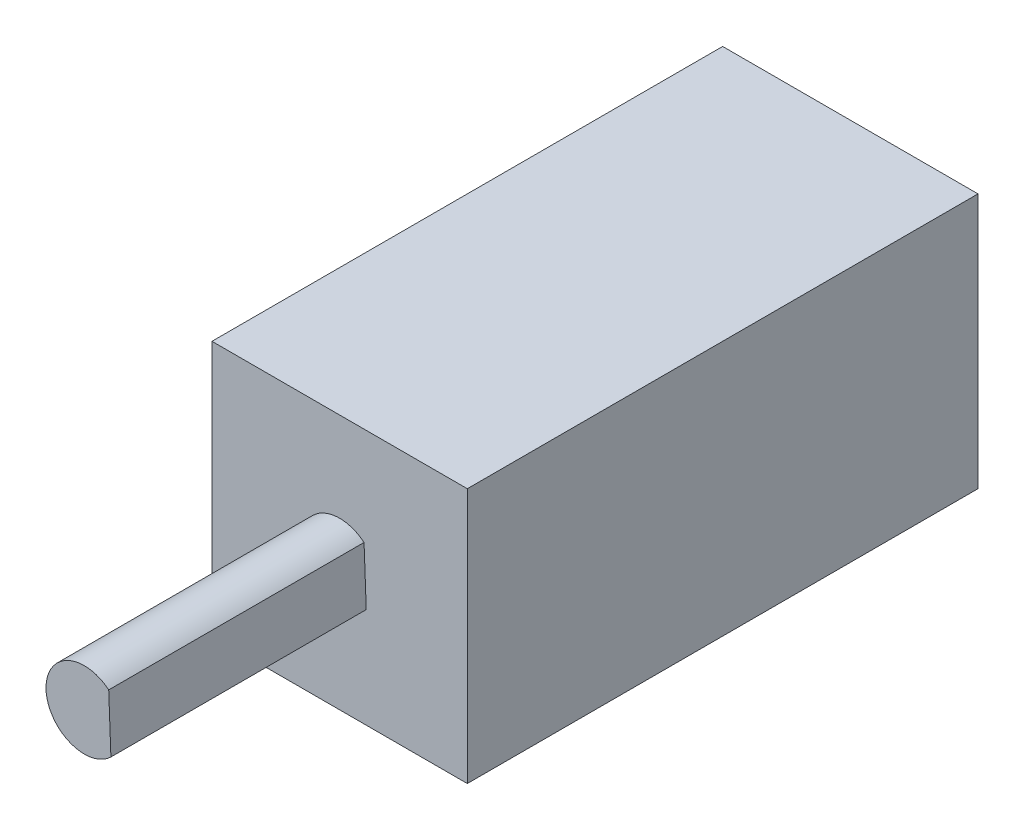
ISO-10303-21;
HEADER;
FILE_DESCRIPTION(('STEP AP214'),'2;1');
FILE_NAME('part.step','',(''),(''),'','','');
FILE_SCHEMA(('AUTOMOTIVE_DESIGN { 1 0 10303 214 1 1 1 1 }'));
ENDSEC;
DATA;
#1=APPLICATION_CONTEXT('core data for automotive mechanical design processes');
#2=APPLICATION_PROTOCOL_DEFINITION('international standard','automotive_design',2000,#1);
#3=PRODUCT_CONTEXT('',#1,'mechanical');
#4=PRODUCT('Part','Part','',(#3));
#5=PRODUCT_RELATED_PRODUCT_CATEGORY('part','',(#4));
#6=PRODUCT_DEFINITION_FORMATION('','',#4);
#7=PRODUCT_DEFINITION_CONTEXT('part definition',#1,'design');
#8=PRODUCT_DEFINITION('design','',#6,#7);
#9=PRODUCT_DEFINITION_SHAPE('','',#8);
#10=(LENGTH_UNIT() NAMED_UNIT(*) SI_UNIT(.MILLI.,.METRE.));
#11=(NAMED_UNIT(*) PLANE_ANGLE_UNIT() SI_UNIT($,.RADIAN.));
#12=(NAMED_UNIT(*) SI_UNIT($,.STERADIAN.) SOLID_ANGLE_UNIT());
#13=UNCERTAINTY_MEASURE_WITH_UNIT(LENGTH_MEASURE(1.E-05),#10,'distance_accuracy_value','');
#14=(GEOMETRIC_REPRESENTATION_CONTEXT(3) GLOBAL_UNCERTAINTY_ASSIGNED_CONTEXT((#13)) GLOBAL_UNIT_ASSIGNED_CONTEXT((#10,
#11,#12)) REPRESENTATION_CONTEXT('',''));
#15=CARTESIAN_POINT('',(0.,0.,0.));
#16=DIRECTION('',(0.,0.,1.));
#17=DIRECTION('',(1.,0.,0.));
#18=AXIS2_PLACEMENT_3D('',#15,#16,#17);
#19=CARTESIAN_POINT('',(0.,0.,20.));
#20=DIRECTION('',(0.,0.,-1.));
#21=DIRECTION('',(-1.,0.,0.));
#22=AXIS2_PLACEMENT_3D('',#19,#20,#21);
#23=PLANE('',#22);
#24=DIRECTION('',(1.,0.,0.));
#25=VECTOR('',#24,1.);
#26=CARTESIAN_POINT('',(-5.,-5.,20.));
#27=LINE('',#26,#25);
#28=CARTESIAN_POINT('',(-5.,-5.,20.));
#29=VERTEX_POINT('',#28);
#30=CARTESIAN_POINT('',(5.,-5.,20.));
#31=VERTEX_POINT('',#30);
#32=EDGE_CURVE('E82',#29,#31,#27,.T.);
#33=ORIENTED_EDGE('',*,*,#32,.T.);
#34=DIRECTION('',(0.,-1.,0.));
#35=VECTOR('',#34,1.);
#36=CARTESIAN_POINT('',(5.,5.,20.));
#37=LINE('',#36,#35);
#38=CARTESIAN_POINT('',(5.,5.,20.));
#39=VERTEX_POINT('',#38);
#40=EDGE_CURVE('E120',#39,#31,#37,.T.);
#41=ORIENTED_EDGE('',*,*,#40,.F.);
#42=DIRECTION('',(1.,0.,0.));
#43=VECTOR('',#42,1.);
#44=CARTESIAN_POINT('',(-5.,5.,20.));
#45=LINE('',#44,#43);
#46=CARTESIAN_POINT('',(-5.,5.,20.));
#47=VERTEX_POINT('',#46);
#48=EDGE_CURVE('E123',#47,#39,#45,.T.);
#49=ORIENTED_EDGE('',*,*,#48,.F.);
#50=DIRECTION('',(0.,-1.,0.));
#51=VECTOR('',#50,1.);
#52=CARTESIAN_POINT('',(-5.,5.,20.));
#53=LINE('',#52,#51);
#54=EDGE_CURVE('E57',#47,#29,#53,.T.);
#55=ORIENTED_EDGE('',*,*,#54,.T.);
#56=EDGE_LOOP('',(#33,#41,#49,#55));
#57=FACE_BOUND('',#56,.T.);
#58=CARTESIAN_POINT('',(0.,0.,20.));
#59=DIRECTION('',(0.,0.,1.));
#60=DIRECTION('',(1.,0.,0.));
#61=AXIS2_PLACEMENT_3D('',#58,#59,#60);
#62=CIRCLE('',#61,1.5);
#63=CARTESIAN_POINT('',(0.95639116203314,1.15555871559385,20.));
#64=VERTEX_POINT('',#63);
#65=CARTESIAN_POINT('',(1.04213779980085,-1.07886459123759,20.));
#66=VERTEX_POINT('',#65);
#67=EDGE_CURVE('E110',#64,#66,#62,.T.);
#68=ORIENTED_EDGE('',*,*,#67,.F.);
#69=DIRECTION('',(-0.0383470621781279,0.999264480916993,0.));
#70=VECTOR('',#69,1.);
#71=CARTESIAN_POINT('',(0.95639116203314,1.15555871559385,20.));
#72=LINE('',#71,#70);
#73=EDGE_CURVE('E48',#66,#64,#72,.T.);
#74=ORIENTED_EDGE('',*,*,#73,.F.);
#75=EDGE_LOOP('',(#68,#74));
#76=FACE_BOUND('',#75,.T.);
#77=ADVANCED_FACE('F34',(#57,#76),#23,.F.);
#78=CARTESIAN_POINT('',(-5.,-5.,20.));
#79=DIRECTION('',(0.,1.,0.));
#80=DIRECTION('',(0.,0.,1.));
#81=AXIS2_PLACEMENT_3D('',#78,#79,#80);
#82=PLANE('',#81);
#83=DIRECTION('',(1.,0.,0.));
#84=VECTOR('',#83,1.);
#85=CARTESIAN_POINT('',(-5.,-5.,0.));
#86=LINE('',#85,#84);
#87=CARTESIAN_POINT('',(-5.,-5.,0.));
#88=VERTEX_POINT('',#87);
#89=CARTESIAN_POINT('',(5.,-5.,0.));
#90=VERTEX_POINT('',#89);
#91=EDGE_CURVE('E111',#88,#90,#86,.T.);
#92=ORIENTED_EDGE('',*,*,#91,.T.);
#93=DIRECTION('',(0.,0.,-1.));
#94=VECTOR('',#93,1.);
#95=CARTESIAN_POINT('',(5.,-5.,20.));
#96=LINE('',#95,#94);
#97=EDGE_CURVE('E11',#31,#90,#96,.T.);
#98=ORIENTED_EDGE('',*,*,#97,.F.);
#99=ORIENTED_EDGE('',*,*,#32,.F.);
#100=DIRECTION('',(0.,0.,-1.));
#101=VECTOR('',#100,1.);
#102=CARTESIAN_POINT('',(-5.,-5.,20.));
#103=LINE('',#102,#101);
#104=EDGE_CURVE('E126',#29,#88,#103,.T.);
#105=ORIENTED_EDGE('',*,*,#104,.T.);
#106=EDGE_LOOP('',(#92,#98,#99,#105));
#107=FACE_BOUND('',#106,.T.);
#108=ADVANCED_FACE('F36',(#107),#82,.F.);
#109=CARTESIAN_POINT('',(5.,5.,20.));
#110=DIRECTION('',(1.,0.,0.));
#111=DIRECTION('',(0.,0.,-1.));
#112=AXIS2_PLACEMENT_3D('',#109,#110,#111);
#113=PLANE('',#112);
#114=DIRECTION('',(0.,-1.,0.));
#115=VECTOR('',#114,1.);
#116=CARTESIAN_POINT('',(5.,5.,0.));
#117=LINE('',#116,#115);
#118=CARTESIAN_POINT('',(5.,5.,0.));
#119=VERTEX_POINT('',#118);
#120=EDGE_CURVE('E114',#119,#90,#117,.T.);
#121=ORIENTED_EDGE('',*,*,#120,.F.);
#122=DIRECTION('',(0.,0.,-1.));
#123=VECTOR('',#122,1.);
#124=CARTESIAN_POINT('',(5.,5.,20.));
#125=LINE('',#124,#123);
#126=EDGE_CURVE('E42',#39,#119,#125,.T.);
#127=ORIENTED_EDGE('',*,*,#126,.F.);
#128=ORIENTED_EDGE('',*,*,#40,.T.);
#129=ORIENTED_EDGE('',*,*,#97,.T.);
#130=EDGE_LOOP('',(#121,#127,#128,#129));
#131=FACE_BOUND('',#130,.T.);
#132=ADVANCED_FACE('F141',(#131),#113,.T.);
#133=CARTESIAN_POINT('',(-5.,5.,20.));
#134=DIRECTION('',(0.,1.,0.));
#135=DIRECTION('',(0.,0.,1.));
#136=AXIS2_PLACEMENT_3D('',#133,#134,#135);
#137=PLANE('',#136);
#138=DIRECTION('',(1.,0.,0.));
#139=VECTOR('',#138,1.);
#140=CARTESIAN_POINT('',(-5.,5.,0.));
#141=LINE('',#140,#139);
#142=CARTESIAN_POINT('',(-5.,5.,0.));
#143=VERTEX_POINT('',#142);
#144=EDGE_CURVE('E130',#143,#119,#141,.T.);
#145=ORIENTED_EDGE('',*,*,#144,.F.);
#146=DIRECTION('',(0.,0.,-1.));
#147=VECTOR('',#146,1.);
#148=CARTESIAN_POINT('',(-5.,5.,20.));
#149=LINE('',#148,#147);
#150=EDGE_CURVE('E135',#47,#143,#149,.T.);
#151=ORIENTED_EDGE('',*,*,#150,.F.);
#152=ORIENTED_EDGE('',*,*,#48,.T.);
#153=ORIENTED_EDGE('',*,*,#126,.T.);
#154=EDGE_LOOP('',(#145,#151,#152,#153));
#155=FACE_BOUND('',#154,.T.);
#156=ADVANCED_FACE('F139',(#155),#137,.T.);
#157=CARTESIAN_POINT('',(-5.,5.,20.));
#158=DIRECTION('',(1.,0.,0.));
#159=DIRECTION('',(0.,0.,-1.));
#160=AXIS2_PLACEMENT_3D('',#157,#158,#159);
#161=PLANE('',#160);
#162=DIRECTION('',(0.,-1.,0.));
#163=VECTOR('',#162,1.);
#164=CARTESIAN_POINT('',(-5.,5.,0.));
#165=LINE('',#164,#163);
#166=EDGE_CURVE('E77',#143,#88,#165,.T.);
#167=ORIENTED_EDGE('',*,*,#166,.T.);
#168=ORIENTED_EDGE('',*,*,#104,.F.);
#169=ORIENTED_EDGE('',*,*,#54,.F.);
#170=ORIENTED_EDGE('',*,*,#150,.T.);
#171=EDGE_LOOP('',(#167,#168,#169,#170));
#172=FACE_BOUND('',#171,.T.);
#173=ADVANCED_FACE('F146',(#172),#161,.F.);
#174=CARTESIAN_POINT('',(0.,0.,0.));
#175=DIRECTION('',(0.,0.,-1.));
#176=DIRECTION('',(-1.,0.,0.));
#177=AXIS2_PLACEMENT_3D('',#174,#175,#176);
#178=PLANE('',#177);
#179=ORIENTED_EDGE('',*,*,#91,.F.);
#180=ORIENTED_EDGE('',*,*,#166,.F.);
#181=ORIENTED_EDGE('',*,*,#144,.T.);
#182=ORIENTED_EDGE('',*,*,#120,.T.);
#183=EDGE_LOOP('',(#179,#180,#181,#182));
#184=FACE_BOUND('',#183,.T.);
#185=ADVANCED_FACE('F144',(#184),#178,.T.);
#186=CARTESIAN_POINT('',(0.,0.,30.));
#187=DIRECTION('',(0.,0.,-1.));
#188=DIRECTION('',(-1.,0.,0.));
#189=AXIS2_PLACEMENT_3D('',#186,#187,#188);
#190=CYLINDRICAL_SURFACE('',#189,1.5);
#191=ORIENTED_EDGE('',*,*,#67,.T.);
#192=DIRECTION('',(0.,0.,-1.));
#193=VECTOR('',#192,1.);
#194=CARTESIAN_POINT('',(1.04213779980085,-1.07886459123759,30.));
#195=LINE('',#194,#193);
#196=CARTESIAN_POINT('',(1.04213779980085,-1.07886459123759,30.));
#197=VERTEX_POINT('',#196);
#198=EDGE_CURVE('E98',#197,#66,#195,.T.);
#199=ORIENTED_EDGE('',*,*,#198,.F.);
#200=CARTESIAN_POINT('',(0.,0.,30.));
#201=DIRECTION('',(0.,0.,1.));
#202=DIRECTION('',(1.,0.,0.));
#203=AXIS2_PLACEMENT_3D('',#200,#201,#202);
#204=CIRCLE('',#203,1.5);
#205=CARTESIAN_POINT('',(0.95639116203314,1.15555871559385,30.));
#206=VERTEX_POINT('',#205);
#207=EDGE_CURVE('E104',#206,#197,#204,.T.);
#208=ORIENTED_EDGE('',*,*,#207,.F.);
#209=DIRECTION('',(0.,0.,-1.));
#210=VECTOR('',#209,1.);
#211=CARTESIAN_POINT('',(0.95639116203314,1.15555871559385,30.));
#212=LINE('',#211,#210);
#213=EDGE_CURVE('E101',#206,#64,#212,.T.);
#214=ORIENTED_EDGE('',*,*,#213,.T.);
#215=EDGE_LOOP('',(#191,#199,#208,#214));
#216=FACE_BOUND('',#215,.T.);
#217=ADVANCED_FACE('F109',(#216),#190,.T.);
#218=CARTESIAN_POINT('',(0.95639116203314,1.15555871559385,30.));
#219=DIRECTION('',(-0.999264480916993,-0.0383470621781279,0.));
#220=DIRECTION('',(0.0383470621781279,-0.999264480916993,0.));
#221=AXIS2_PLACEMENT_3D('',#218,#219,#220);
#222=PLANE('',#221);
#223=ORIENTED_EDGE('',*,*,#73,.T.);
#224=ORIENTED_EDGE('',*,*,#213,.F.);
#225=DIRECTION('',(-0.0383470621781279,0.999264480916993,0.));
#226=VECTOR('',#225,1.);
#227=CARTESIAN_POINT('',(0.95639116203314,1.15555871559385,30.));
#228=LINE('',#227,#226);
#229=EDGE_CURVE('E94',#197,#206,#228,.T.);
#230=ORIENTED_EDGE('',*,*,#229,.F.);
#231=ORIENTED_EDGE('',*,*,#198,.T.);
#232=EDGE_LOOP('',(#223,#224,#230,#231));
#233=FACE_BOUND('',#232,.T.);
#234=ADVANCED_FACE('F96',(#233),#222,.F.);
#235=CARTESIAN_POINT('',(0.,0.,30.));
#236=DIRECTION('',(0.,0.,1.));
#237=DIRECTION('',(1.,0.,0.));
#238=AXIS2_PLACEMENT_3D('',#235,#236,#237);
#239=PLANE('',#238);
#240=ORIENTED_EDGE('',*,*,#207,.T.);
#241=ORIENTED_EDGE('',*,*,#229,.T.);
#242=EDGE_LOOP('',(#240,#241));
#243=FACE_BOUND('',#242,.T.);
#244=ADVANCED_FACE('F106',(#243),#239,.T.);
#245=CLOSED_SHELL('',(#77,#108,#132,#156,#173,#185,#217,#234,#244));
#246=MANIFOLD_SOLID_BREP('B2',#245);
#247=ADVANCED_BREP_SHAPE_REPRESENTATION('',(#18,#246),#14);
#248=SHAPE_DEFINITION_REPRESENTATION(#9,#247);
ENDSEC;
END-ISO-10303-21;
